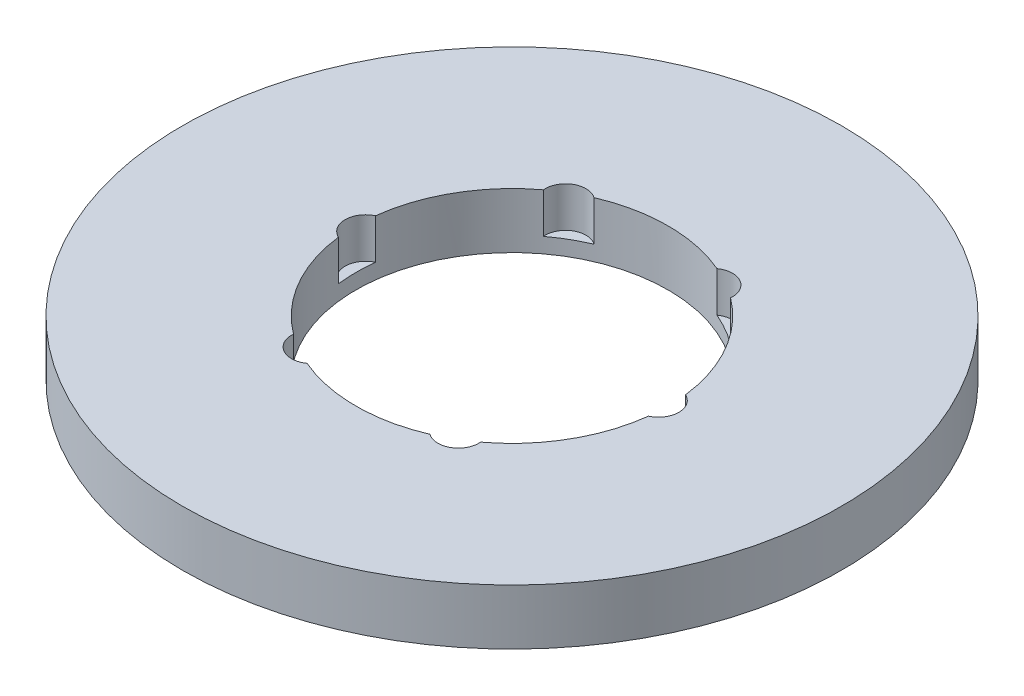
ISO-10303-21;
HEADER;
FILE_DESCRIPTION(('STEP AP214'),'2;1');
FILE_NAME('part.step','',(''),(''),'','','');
FILE_SCHEMA(('AUTOMOTIVE_DESIGN { 1 0 10303 214 1 1 1 1 }'));
ENDSEC;
DATA;
#1=APPLICATION_CONTEXT('core data for automotive mechanical design processes');
#2=APPLICATION_PROTOCOL_DEFINITION('international standard','automotive_design',2000,#1);
#3=PRODUCT_CONTEXT('',#1,'mechanical');
#4=PRODUCT('Part','Part','',(#3));
#5=PRODUCT_RELATED_PRODUCT_CATEGORY('part','',(#4));
#6=PRODUCT_DEFINITION_FORMATION('','',#4);
#7=PRODUCT_DEFINITION_CONTEXT('part definition',#1,'design');
#8=PRODUCT_DEFINITION('design','',#6,#7);
#9=PRODUCT_DEFINITION_SHAPE('','',#8);
#10=(LENGTH_UNIT() NAMED_UNIT(*) SI_UNIT(.MILLI.,.METRE.));
#11=(NAMED_UNIT(*) PLANE_ANGLE_UNIT() SI_UNIT($,.RADIAN.));
#12=(NAMED_UNIT(*) SI_UNIT($,.STERADIAN.) SOLID_ANGLE_UNIT());
#13=UNCERTAINTY_MEASURE_WITH_UNIT(LENGTH_MEASURE(1.E-05),#10,'distance_accuracy_value','');
#14=(GEOMETRIC_REPRESENTATION_CONTEXT(3) GLOBAL_UNCERTAINTY_ASSIGNED_CONTEXT((#13)) GLOBAL_UNIT_ASSIGNED_CONTEXT((#10,
#11,#12)) REPRESENTATION_CONTEXT('',''));
#15=CARTESIAN_POINT('',(0.,0.,0.));
#16=DIRECTION('',(0.,0.,1.));
#17=DIRECTION('',(1.,0.,0.));
#18=AXIS2_PLACEMENT_3D('',#15,#16,#17);
#19=CARTESIAN_POINT('',(0.,16.,0.));
#20=DIRECTION('',(0.,-1.,0.));
#21=DIRECTION('',(0.,0.,-1.));
#22=AXIS2_PLACEMENT_3D('',#19,#20,#21);
#23=CYLINDRICAL_SURFACE('',#22,95.);
#24=CARTESIAN_POINT('',(0.,16.,0.));
#25=DIRECTION('',(0.,1.,0.));
#26=DIRECTION('',(0.,0.,1.));
#27=AXIS2_PLACEMENT_3D('',#24,#25,#26);
#28=CIRCLE('',#27,95.);
#29=CARTESIAN_POINT('',(0.,16.,95.));
#30=VERTEX_POINT('',#29);
#31=EDGE_CURVE('E162',#30,#30,#28,.T.);
#32=ORIENTED_EDGE('',*,*,#31,.F.);
#33=EDGE_LOOP('',(#32));
#34=FACE_BOUND('',#33,.T.);
#35=CARTESIAN_POINT('',(0.,0.,0.));
#36=DIRECTION('',(0.,1.,0.));
#37=DIRECTION('',(0.,0.,1.));
#38=AXIS2_PLACEMENT_3D('',#35,#36,#37);
#39=CIRCLE('',#38,95.);
#40=CARTESIAN_POINT('',(0.,0.,95.));
#41=VERTEX_POINT('',#40);
#42=EDGE_CURVE('E157',#41,#41,#39,.T.);
#43=ORIENTED_EDGE('',*,*,#42,.T.);
#44=EDGE_LOOP('',(#43));
#45=FACE_BOUND('',#44,.T.);
#46=ADVANCED_FACE('F39',(#34,#45),#23,.T.);
#47=CARTESIAN_POINT('',(0.,16.,0.));
#48=DIRECTION('',(0.,1.,0.));
#49=DIRECTION('',(0.,0.,1.));
#50=AXIS2_PLACEMENT_3D('',#47,#48,#49);
#51=PLANE('',#50);
#52=CARTESIAN_POINT('',(-21.1127537301042,16.,-36.5683621482288));
#53=DIRECTION('',(0.,1.,0.));
#54=DIRECTION('',(-0.866025403784433,0.,0.50000000000001));
#55=AXIS2_PLACEMENT_3D('',#52,#53,#54);
#56=CIRCLE('',#55,5.87999764689264);
#57=CARTESIAN_POINT('',(-17.7142200055111,16.,-41.3667307095491));
#58=VERTEX_POINT('',#57);
#59=CARTESIAN_POINT('',(-26.9675296632246,16.,-36.0243298877731));
#60=VERTEX_POINT('',#59);
#61=EDGE_CURVE('E218',#58,#60,#56,.T.);
#62=ORIENTED_EDGE('',*,*,#61,.F.);
#63=CARTESIAN_POINT('',(0.,16.,0.));
#64=DIRECTION('',(0.,1.,0.));
#65=DIRECTION('',(0.,0.,1.));
#66=AXIS2_PLACEMENT_3D('',#63,#64,#65);
#67=CIRCLE('',#66,45.);
#68=CARTESIAN_POINT('',(17.7142200055103,16.,-41.3667307095494));
#69=VERTEX_POINT('',#68);
#70=EDGE_CURVE('E169',#69,#58,#67,.T.);
#71=ORIENTED_EDGE('',*,*,#70,.F.);
#72=CARTESIAN_POINT('',(21.1127537301034,16.,-36.5683621482292));
#73=DIRECTION('',(0.,1.,0.));
#74=DIRECTION('',(-0.866025403784443,0.,-0.499999999999992));
#75=AXIS2_PLACEMENT_3D('',#72,#73,#74);
#76=CIRCLE('',#75,5.87999764689264);
#77=CARTESIAN_POINT('',(26.9675296632239,16.,-36.0243298877736));
#78=VERTEX_POINT('',#77);
#79=EDGE_CURVE('E285',#78,#69,#76,.T.);
#80=ORIENTED_EDGE('',*,*,#79,.F.);
#81=CARTESIAN_POINT('',(44.6817496687349,16.,-5.34240082177588));
#82=VERTEX_POINT('',#81);
#83=EDGE_CURVE('E174',#82,#78,#67,.T.);
#84=ORIENTED_EDGE('',*,*,#83,.F.);
#85=CARTESIAN_POINT('',(42.2255074602075,16.,0.));
#86=DIRECTION('',(0.,1.,0.));
#87=DIRECTION('',(0.,0.,-1.));
#88=AXIS2_PLACEMENT_3D('',#85,#86,#87);
#89=CIRCLE('',#88,5.87999764689264);
#90=CARTESIAN_POINT('',(44.6817496687349,16.,5.34240082177588));
#91=VERTEX_POINT('',#90);
#92=EDGE_CURVE('E280',#91,#82,#89,.T.);
#93=ORIENTED_EDGE('',*,*,#92,.F.);
#94=CARTESIAN_POINT('',(26.9675296632244,16.,36.0243298877732));
#95=VERTEX_POINT('',#94);
#96=EDGE_CURVE('E164',#95,#91,#67,.T.);
#97=ORIENTED_EDGE('',*,*,#96,.F.);
#98=CARTESIAN_POINT('',(21.1127537301039,16.,36.5683621482289));
#99=DIRECTION('',(0.,1.,0.));
#100=DIRECTION('',(0.866025403784436,0.,-0.500000000000004));
#101=AXIS2_PLACEMENT_3D('',#98,#99,#100);
#102=CIRCLE('',#101,5.87999764689264);
#103=CARTESIAN_POINT('',(17.7142200055108,16.,41.3667307095492));
#104=VERTEX_POINT('',#103);
#105=EDGE_CURVE('E269',#104,#95,#102,.T.);
#106=ORIENTED_EDGE('',*,*,#105,.F.);
#107=CARTESIAN_POINT('',(-17.7142200055106,16.,41.3667307095493));
#108=VERTEX_POINT('',#107);
#109=EDGE_CURVE('E149',#108,#104,#67,.T.);
#110=ORIENTED_EDGE('',*,*,#109,.F.);
#111=CARTESIAN_POINT('',(-21.1127537301037,16.,36.5683621482291));
#112=DIRECTION('',(0.,1.,0.));
#113=DIRECTION('',(0.86602540378444,0.,0.499999999999998));
#114=AXIS2_PLACEMENT_3D('',#111,#112,#113);
#115=CIRCLE('',#114,5.87999764689264);
#116=CARTESIAN_POINT('',(-26.9675296632241,16.,36.0243298877734));
#117=VERTEX_POINT('',#116);
#118=EDGE_CURVE('E128',#117,#108,#115,.T.);
#119=ORIENTED_EDGE('',*,*,#118,.F.);
#120=CARTESIAN_POINT('',(-44.6817496687349,16.,5.34240082177588));
#121=VERTEX_POINT('',#120);
#122=EDGE_CURVE('E148',#121,#117,#67,.T.);
#123=ORIENTED_EDGE('',*,*,#122,.F.);
#124=CARTESIAN_POINT('',(-42.2255074602075,16.,0.));
#125=DIRECTION('',(0.,1.,0.));
#126=DIRECTION('',(0.,0.,1.));
#127=AXIS2_PLACEMENT_3D('',#124,#125,#126);
#128=CIRCLE('',#127,5.87999764689264);
#129=CARTESIAN_POINT('',(-44.6817496687349,16.,-5.34240082177588));
#130=VERTEX_POINT('',#129);
#131=EDGE_CURVE('E179',#130,#121,#128,.T.);
#132=ORIENTED_EDGE('',*,*,#131,.F.);
#133=EDGE_CURVE('E161',#60,#130,#67,.T.);
#134=ORIENTED_EDGE('',*,*,#133,.F.);
#135=EDGE_LOOP('',(#62,#71,#80,#84,#93,#97,#106,#110,#119,#123,#132,#134));
#136=FACE_BOUND('',#135,.T.);
#137=ORIENTED_EDGE('',*,*,#31,.T.);
#138=EDGE_LOOP('',(#137));
#139=FACE_BOUND('',#138,.T.);
#140=ADVANCED_FACE('F141',(#136,#139),#51,.T.);
#141=CARTESIAN_POINT('',(0.,0.,0.));
#142=DIRECTION('',(0.,1.,0.));
#143=DIRECTION('',(0.,0.,1.));
#144=AXIS2_PLACEMENT_3D('',#141,#142,#143);
#145=PLANE('',#144);
#146=CARTESIAN_POINT('',(0.,0.,0.));
#147=DIRECTION('',(0.,1.,0.));
#148=DIRECTION('',(0.,0.,1.));
#149=AXIS2_PLACEMENT_3D('',#146,#147,#148);
#150=CIRCLE('',#149,45.);
#151=CARTESIAN_POINT('',(0.,0.,45.));
#152=VERTEX_POINT('',#151);
#153=EDGE_CURVE('E166',#152,#152,#150,.T.);
#154=ORIENTED_EDGE('',*,*,#153,.T.);
#155=EDGE_LOOP('',(#154));
#156=FACE_BOUND('',#155,.T.);
#157=ORIENTED_EDGE('',*,*,#42,.F.);
#158=EDGE_LOOP('',(#157));
#159=FACE_BOUND('',#158,.T.);
#160=ADVANCED_FACE('F234',(#156,#159),#145,.F.);
#161=CARTESIAN_POINT('',(0.,16.,0.));
#162=DIRECTION('',(0.,-1.,0.));
#163=DIRECTION('',(0.,0.,-1.));
#164=AXIS2_PLACEMENT_3D('',#161,#162,#163);
#165=CYLINDRICAL_SURFACE('',#164,45.);
#166=DIRECTION('',(0.,1.,0.));
#167=VECTOR('',#166,1.);
#168=CARTESIAN_POINT('',(-17.7142200055111,10.1884837905364,-41.366730709549));
#169=LINE('',#168,#167);
#170=CARTESIAN_POINT('',(-17.7142200055111,4.37696758107275,-41.3667307095491));
#171=VERTEX_POINT('',#170);
#172=EDGE_CURVE('E11',#171,#58,#169,.T.);
#173=ORIENTED_EDGE('',*,*,#172,.F.);
#174=CARTESIAN_POINT('',(0.,4.37696758107275,0.));
#175=DIRECTION('',(0.,1.,0.));
#176=DIRECTION('',(0.,0.,1.));
#177=AXIS2_PLACEMENT_3D('',#174,#175,#176);
#178=CIRCLE('',#177,45.);
#179=CARTESIAN_POINT('',(-26.9675296632246,4.37696758107275,-36.0243298877731));
#180=VERTEX_POINT('',#179);
#181=EDGE_CURVE('E214',#171,#180,#178,.T.);
#182=ORIENTED_EDGE('',*,*,#181,.T.);
#183=DIRECTION('',(0.,1.,0.));
#184=VECTOR('',#183,1.);
#185=CARTESIAN_POINT('',(-26.9675296632246,10.1884837905364,-36.024329887773));
#186=LINE('',#185,#184);
#187=EDGE_CURVE('E46',#60,#180,#186,.F.);
#188=ORIENTED_EDGE('',*,*,#187,.F.);
#189=ORIENTED_EDGE('',*,*,#133,.T.);
#190=DIRECTION('',(0.,1.,0.));
#191=VECTOR('',#190,1.);
#192=CARTESIAN_POINT('',(-44.6817496687349,10.1884837905364,-5.34240082177588));
#193=LINE('',#192,#191);
#194=CARTESIAN_POINT('',(-44.6817496687349,4.37696758107275,-5.34240082177588));
#195=VERTEX_POINT('',#194);
#196=EDGE_CURVE('E187',#195,#130,#193,.T.);
#197=ORIENTED_EDGE('',*,*,#196,.F.);
#198=CARTESIAN_POINT('',(0.,4.37696758107275,0.));
#199=DIRECTION('',(0.,1.,0.));
#200=DIRECTION('',(0.,0.,1.));
#201=AXIS2_PLACEMENT_3D('',#198,#199,#200);
#202=CIRCLE('',#201,45.);
#203=CARTESIAN_POINT('',(-44.6817496687349,4.37696758107275,5.34240082177588));
#204=VERTEX_POINT('',#203);
#205=EDGE_CURVE('E184',#195,#204,#202,.T.);
#206=ORIENTED_EDGE('',*,*,#205,.T.);
#207=DIRECTION('',(0.,1.,0.));
#208=VECTOR('',#207,1.);
#209=CARTESIAN_POINT('',(-44.6817496687349,10.1884837905364,5.34240082177588));
#210=LINE('',#209,#208);
#211=EDGE_CURVE('E158',#121,#204,#210,.F.);
#212=ORIENTED_EDGE('',*,*,#211,.F.);
#213=ORIENTED_EDGE('',*,*,#122,.T.);
#214=DIRECTION('',(0.,1.,0.));
#215=VECTOR('',#214,1.);
#216=CARTESIAN_POINT('',(-26.9675296632241,10.1884837905364,36.0243298877734));
#217=LINE('',#216,#215);
#218=CARTESIAN_POINT('',(-26.9675296632241,4.37696758107275,36.0243298877734));
#219=VERTEX_POINT('',#218);
#220=EDGE_CURVE('E127',#219,#117,#217,.T.);
#221=ORIENTED_EDGE('',*,*,#220,.F.);
#222=CARTESIAN_POINT('',(0.,4.37696758107275,0.));
#223=DIRECTION('',(0.,1.,0.));
#224=DIRECTION('',(0.,0.,1.));
#225=AXIS2_PLACEMENT_3D('',#222,#223,#224);
#226=CIRCLE('',#225,45.);
#227=CARTESIAN_POINT('',(-17.7142200055106,4.37696758107275,41.3667307095493));
#228=VERTEX_POINT('',#227);
#229=EDGE_CURVE('E189',#219,#228,#226,.T.);
#230=ORIENTED_EDGE('',*,*,#229,.T.);
#231=DIRECTION('',(0.,1.,0.));
#232=VECTOR('',#231,1.);
#233=CARTESIAN_POINT('',(-17.7142200055106,10.1884837905364,41.3667307095493));
#234=LINE('',#233,#232);
#235=EDGE_CURVE('E140',#108,#228,#234,.F.);
#236=ORIENTED_EDGE('',*,*,#235,.F.);
#237=ORIENTED_EDGE('',*,*,#109,.T.);
#238=DIRECTION('',(0.,1.,0.));
#239=VECTOR('',#238,1.);
#240=CARTESIAN_POINT('',(17.7142200055108,10.1884837905364,41.3667307095492));
#241=LINE('',#240,#239);
#242=CARTESIAN_POINT('',(17.7142200055108,4.37696758107275,41.3667307095492));
#243=VERTEX_POINT('',#242);
#244=EDGE_CURVE('E196',#243,#104,#241,.T.);
#245=ORIENTED_EDGE('',*,*,#244,.F.);
#246=CARTESIAN_POINT('',(0.,4.37696758107275,0.));
#247=DIRECTION('',(0.,1.,0.));
#248=DIRECTION('',(0.,0.,1.));
#249=AXIS2_PLACEMENT_3D('',#246,#247,#248);
#250=CIRCLE('',#249,45.);
#251=CARTESIAN_POINT('',(26.9675296632244,4.37696758107275,36.0243298877732));
#252=VERTEX_POINT('',#251);
#253=EDGE_CURVE('E136',#243,#252,#250,.T.);
#254=ORIENTED_EDGE('',*,*,#253,.T.);
#255=DIRECTION('',(0.,1.,0.));
#256=VECTOR('',#255,1.);
#257=CARTESIAN_POINT('',(26.9675296632244,10.1884837905364,36.0243298877732));
#258=LINE('',#257,#256);
#259=EDGE_CURVE('E194',#95,#252,#258,.F.);
#260=ORIENTED_EDGE('',*,*,#259,.F.);
#261=ORIENTED_EDGE('',*,*,#96,.T.);
#262=DIRECTION('',(0.,1.,0.));
#263=VECTOR('',#262,1.);
#264=CARTESIAN_POINT('',(44.6817496687349,10.1884837905364,5.34240082177588));
#265=LINE('',#264,#263);
#266=CARTESIAN_POINT('',(44.6817496687349,4.37696758107275,5.34240082177588));
#267=VERTEX_POINT('',#266);
#268=EDGE_CURVE('E206',#267,#91,#265,.T.);
#269=ORIENTED_EDGE('',*,*,#268,.F.);
#270=CARTESIAN_POINT('',(0.,4.37696758107275,0.));
#271=DIRECTION('',(0.,1.,0.));
#272=DIRECTION('',(0.,0.,1.));
#273=AXIS2_PLACEMENT_3D('',#270,#271,#272);
#274=CIRCLE('',#273,45.);
#275=CARTESIAN_POINT('',(44.6817496687349,4.37696758107275,-5.34240082177588));
#276=VERTEX_POINT('',#275);
#277=EDGE_CURVE('E199',#267,#276,#274,.T.);
#278=ORIENTED_EDGE('',*,*,#277,.T.);
#279=DIRECTION('',(0.,1.,0.));
#280=VECTOR('',#279,1.);
#281=CARTESIAN_POINT('',(44.6817496687349,10.1884837905364,-5.34240082177588));
#282=LINE('',#281,#280);
#283=EDGE_CURVE('E201',#82,#276,#282,.F.);
#284=ORIENTED_EDGE('',*,*,#283,.F.);
#285=ORIENTED_EDGE('',*,*,#83,.T.);
#286=DIRECTION('',(0.,1.,0.));
#287=VECTOR('',#286,1.);
#288=CARTESIAN_POINT('',(26.9675296632239,10.1884837905364,-36.0243298877736));
#289=LINE('',#288,#287);
#290=CARTESIAN_POINT('',(26.9675296632239,4.37696758107275,-36.0243298877736));
#291=VERTEX_POINT('',#290);
#292=EDGE_CURVE('E213',#291,#78,#289,.T.);
#293=ORIENTED_EDGE('',*,*,#292,.F.);
#294=CARTESIAN_POINT('',(0.,4.37696758107275,0.));
#295=DIRECTION('',(0.,1.,0.));
#296=DIRECTION('',(0.,0.,1.));
#297=AXIS2_PLACEMENT_3D('',#294,#295,#296);
#298=CIRCLE('',#297,45.);
#299=CARTESIAN_POINT('',(17.7142200055103,4.37696758107275,-41.3667307095494));
#300=VERTEX_POINT('',#299);
#301=EDGE_CURVE('E208',#291,#300,#298,.T.);
#302=ORIENTED_EDGE('',*,*,#301,.T.);
#303=DIRECTION('',(0.,1.,0.));
#304=VECTOR('',#303,1.);
#305=CARTESIAN_POINT('',(17.7142200055103,10.1884837905364,-41.3667307095494));
#306=LINE('',#305,#304);
#307=EDGE_CURVE('E211',#69,#300,#306,.F.);
#308=ORIENTED_EDGE('',*,*,#307,.F.);
#309=ORIENTED_EDGE('',*,*,#70,.T.);
#310=EDGE_LOOP('',(#173,#182,#188,#189,#197,#206,#212,#213,#221,#230,#236,#237,#245,#254,#260,
#261,#269,#278,#284,#285,#293,#302,#308,#309));
#311=FACE_BOUND('',#310,.T.);
#312=ORIENTED_EDGE('',*,*,#153,.F.);
#313=EDGE_LOOP('',(#312));
#314=FACE_BOUND('',#313,.T.);
#315=ADVANCED_FACE('F152',(#311,#314),#165,.F.);
#316=CARTESIAN_POINT('',(-42.2255074602075,4.37696758107275,0.));
#317=DIRECTION('',(0.,1.,0.));
#318=DIRECTION('',(0.,0.,1.));
#319=AXIS2_PLACEMENT_3D('',#316,#317,#318);
#320=CYLINDRICAL_SURFACE('',#319,5.87999764689264);
#321=ORIENTED_EDGE('',*,*,#196,.T.);
#322=ORIENTED_EDGE('',*,*,#131,.T.);
#323=ORIENTED_EDGE('',*,*,#211,.T.);
#324=CARTESIAN_POINT('',(-42.2255074602075,4.37696758107275,0.));
#325=DIRECTION('',(0.,1.,0.));
#326=DIRECTION('',(0.,0.,1.));
#327=AXIS2_PLACEMENT_3D('',#324,#325,#326);
#328=CIRCLE('',#327,5.87999764689264);
#329=EDGE_CURVE('E180',#195,#204,#328,.T.);
#330=ORIENTED_EDGE('',*,*,#329,.F.);
#331=EDGE_LOOP('',(#321,#322,#323,#330));
#332=FACE_BOUND('',#331,.T.);
#333=ADVANCED_FACE('F244',(#332),#320,.F.);
#334=CARTESIAN_POINT('',(-42.2255074602075,4.37696758107275,0.));
#335=DIRECTION('',(0.,1.,0.));
#336=DIRECTION('',(0.,0.,1.));
#337=AXIS2_PLACEMENT_3D('',#334,#335,#336);
#338=PLANE('',#337);
#339=ORIENTED_EDGE('',*,*,#329,.T.);
#340=ORIENTED_EDGE('',*,*,#205,.F.);
#341=EDGE_LOOP('',(#339,#340));
#342=FACE_BOUND('',#341,.T.);
#343=ADVANCED_FACE('F248',(#342),#338,.T.);
#344=CARTESIAN_POINT('',(-21.1127537301037,4.37696758107275,36.5683621482291));
#345=DIRECTION('',(0.,1.,0.));
#346=DIRECTION('',(0.,0.,1.));
#347=AXIS2_PLACEMENT_3D('',#344,#345,#346);
#348=CYLINDRICAL_SURFACE('',#347,5.87999764689264);
#349=ORIENTED_EDGE('',*,*,#220,.T.);
#350=ORIENTED_EDGE('',*,*,#118,.T.);
#351=ORIENTED_EDGE('',*,*,#235,.T.);
#352=CARTESIAN_POINT('',(-21.1127537301037,4.37696758107275,36.5683621482291));
#353=DIRECTION('',(0.,1.,0.));
#354=DIRECTION('',(0.86602540378444,0.,0.499999999999998));
#355=AXIS2_PLACEMENT_3D('',#352,#353,#354);
#356=CIRCLE('',#355,5.87999764689264);
#357=EDGE_CURVE('E135',#219,#228,#356,.T.);
#358=ORIENTED_EDGE('',*,*,#357,.F.);
#359=EDGE_LOOP('',(#349,#350,#351,#358));
#360=FACE_BOUND('',#359,.T.);
#361=ADVANCED_FACE('F126',(#360),#348,.F.);
#362=CARTESIAN_POINT('',(-21.1127537301037,4.37696758107275,36.5683621482291));
#363=DIRECTION('',(0.,1.,0.));
#364=DIRECTION('',(0.86602540378444,0.,0.499999999999998));
#365=AXIS2_PLACEMENT_3D('',#362,#363,#364);
#366=PLANE('',#365);
#367=ORIENTED_EDGE('',*,*,#357,.T.);
#368=ORIENTED_EDGE('',*,*,#229,.F.);
#369=EDGE_LOOP('',(#367,#368));
#370=FACE_BOUND('',#369,.T.);
#371=ADVANCED_FACE('F258',(#370),#366,.T.);
#372=CARTESIAN_POINT('',(21.1127537301039,4.37696758107275,36.5683621482289));
#373=DIRECTION('',(0.,1.,0.));
#374=DIRECTION('',(0.,0.,1.));
#375=AXIS2_PLACEMENT_3D('',#372,#373,#374);
#376=CYLINDRICAL_SURFACE('',#375,5.87999764689264);
#377=ORIENTED_EDGE('',*,*,#244,.T.);
#378=ORIENTED_EDGE('',*,*,#105,.T.);
#379=ORIENTED_EDGE('',*,*,#259,.T.);
#380=CARTESIAN_POINT('',(21.1127537301039,4.37696758107275,36.5683621482289));
#381=DIRECTION('',(0.,1.,0.));
#382=DIRECTION('',(0.866025403784436,0.,-0.500000000000004));
#383=AXIS2_PLACEMENT_3D('',#380,#381,#382);
#384=CIRCLE('',#383,5.87999764689264);
#385=EDGE_CURVE('E147',#243,#252,#384,.T.);
#386=ORIENTED_EDGE('',*,*,#385,.F.);
#387=EDGE_LOOP('',(#377,#378,#379,#386));
#388=FACE_BOUND('',#387,.T.);
#389=ADVANCED_FACE('F256',(#388),#376,.F.);
#390=CARTESIAN_POINT('',(21.1127537301039,4.37696758107275,36.5683621482289));
#391=DIRECTION('',(0.,1.,0.));
#392=DIRECTION('',(0.866025403784436,0.,-0.500000000000004));
#393=AXIS2_PLACEMENT_3D('',#390,#391,#392);
#394=PLANE('',#393);
#395=ORIENTED_EDGE('',*,*,#385,.T.);
#396=ORIENTED_EDGE('',*,*,#253,.F.);
#397=EDGE_LOOP('',(#395,#396));
#398=FACE_BOUND('',#397,.T.);
#399=ADVANCED_FACE('F263',(#398),#394,.T.);
#400=CARTESIAN_POINT('',(42.2255074602075,4.37696758107275,0.));
#401=DIRECTION('',(0.,1.,0.));
#402=DIRECTION('',(0.,0.,1.));
#403=AXIS2_PLACEMENT_3D('',#400,#401,#402);
#404=CYLINDRICAL_SURFACE('',#403,5.87999764689264);
#405=ORIENTED_EDGE('',*,*,#268,.T.);
#406=ORIENTED_EDGE('',*,*,#92,.T.);
#407=ORIENTED_EDGE('',*,*,#283,.T.);
#408=CARTESIAN_POINT('',(42.2255074602075,4.37696758107275,0.));
#409=DIRECTION('',(0.,1.,0.));
#410=DIRECTION('',(0.,0.,-1.));
#411=AXIS2_PLACEMENT_3D('',#408,#409,#410);
#412=CIRCLE('',#411,5.87999764689264);
#413=EDGE_CURVE('E273',#267,#276,#412,.T.);
#414=ORIENTED_EDGE('',*,*,#413,.F.);
#415=EDGE_LOOP('',(#405,#406,#407,#414));
#416=FACE_BOUND('',#415,.T.);
#417=ADVANCED_FACE('F297',(#416),#404,.F.);
#418=CARTESIAN_POINT('',(42.2255074602075,4.37696758107275,0.));
#419=DIRECTION('',(0.,1.,0.));
#420=DIRECTION('',(0.,0.,-1.));
#421=AXIS2_PLACEMENT_3D('',#418,#419,#420);
#422=PLANE('',#421);
#423=ORIENTED_EDGE('',*,*,#413,.T.);
#424=ORIENTED_EDGE('',*,*,#277,.F.);
#425=EDGE_LOOP('',(#423,#424));
#426=FACE_BOUND('',#425,.T.);
#427=ADVANCED_FACE('F299',(#426),#422,.T.);
#428=CARTESIAN_POINT('',(21.1127537301034,4.37696758107275,-36.5683621482292));
#429=DIRECTION('',(0.,1.,0.));
#430=DIRECTION('',(0.,0.,1.));
#431=AXIS2_PLACEMENT_3D('',#428,#429,#430);
#432=CYLINDRICAL_SURFACE('',#431,5.87999764689264);
#433=ORIENTED_EDGE('',*,*,#292,.T.);
#434=ORIENTED_EDGE('',*,*,#79,.T.);
#435=ORIENTED_EDGE('',*,*,#307,.T.);
#436=CARTESIAN_POINT('',(21.1127537301034,4.37696758107275,-36.5683621482292));
#437=DIRECTION('',(0.,1.,0.));
#438=DIRECTION('',(-0.866025403784443,0.,-0.499999999999992));
#439=AXIS2_PLACEMENT_3D('',#436,#437,#438);
#440=CIRCLE('',#439,5.87999764689264);
#441=EDGE_CURVE('E56',#291,#300,#440,.T.);
#442=ORIENTED_EDGE('',*,*,#441,.F.);
#443=EDGE_LOOP('',(#433,#434,#435,#442));
#444=FACE_BOUND('',#443,.T.);
#445=ADVANCED_FACE('F292',(#444),#432,.F.);
#446=CARTESIAN_POINT('',(21.1127537301034,4.37696758107275,-36.5683621482292));
#447=DIRECTION('',(0.,1.,0.));
#448=DIRECTION('',(-0.866025403784443,0.,-0.499999999999992));
#449=AXIS2_PLACEMENT_3D('',#446,#447,#448);
#450=PLANE('',#449);
#451=ORIENTED_EDGE('',*,*,#441,.T.);
#452=ORIENTED_EDGE('',*,*,#301,.F.);
#453=EDGE_LOOP('',(#451,#452));
#454=FACE_BOUND('',#453,.T.);
#455=ADVANCED_FACE('F226',(#454),#450,.T.);
#456=CARTESIAN_POINT('',(-21.1127537301042,4.37696758107275,-36.5683621482288));
#457=DIRECTION('',(0.,1.,0.));
#458=DIRECTION('',(0.,0.,1.));
#459=AXIS2_PLACEMENT_3D('',#456,#457,#458);
#460=CYLINDRICAL_SURFACE('',#459,5.87999764689264);
#461=ORIENTED_EDGE('',*,*,#172,.T.);
#462=ORIENTED_EDGE('',*,*,#61,.T.);
#463=ORIENTED_EDGE('',*,*,#187,.T.);
#464=CARTESIAN_POINT('',(-21.1127537301042,4.37696758107275,-36.5683621482288));
#465=DIRECTION('',(0.,1.,0.));
#466=DIRECTION('',(-0.866025403784433,0.,0.50000000000001));
#467=AXIS2_PLACEMENT_3D('',#464,#465,#466);
#468=CIRCLE('',#467,5.87999764689264);
#469=EDGE_CURVE('E55',#171,#180,#468,.T.);
#470=ORIENTED_EDGE('',*,*,#469,.F.);
#471=EDGE_LOOP('',(#461,#462,#463,#470));
#472=FACE_BOUND('',#471,.T.);
#473=ADVANCED_FACE('F217',(#472),#460,.F.);
#474=CARTESIAN_POINT('',(-21.1127537301042,4.37696758107275,-36.5683621482288));
#475=DIRECTION('',(0.,1.,0.));
#476=DIRECTION('',(-0.866025403784433,0.,0.50000000000001));
#477=AXIS2_PLACEMENT_3D('',#474,#475,#476);
#478=PLANE('',#477);
#479=ORIENTED_EDGE('',*,*,#469,.T.);
#480=ORIENTED_EDGE('',*,*,#181,.F.);
#481=EDGE_LOOP('',(#479,#480));
#482=FACE_BOUND('',#481,.T.);
#483=ADVANCED_FACE('F219',(#482),#478,.T.);
#484=CLOSED_SHELL('',(#46,#140,#160,#315,#333,#343,#361,#371,#389,#399,#417,#427,#445,#455,#473,#483));
#485=MANIFOLD_SOLID_BREP('B2',#484);
#486=ADVANCED_BREP_SHAPE_REPRESENTATION('',(#18,#485),#14);
#487=SHAPE_DEFINITION_REPRESENTATION(#9,#486);
ENDSEC;
END-ISO-10303-21;
